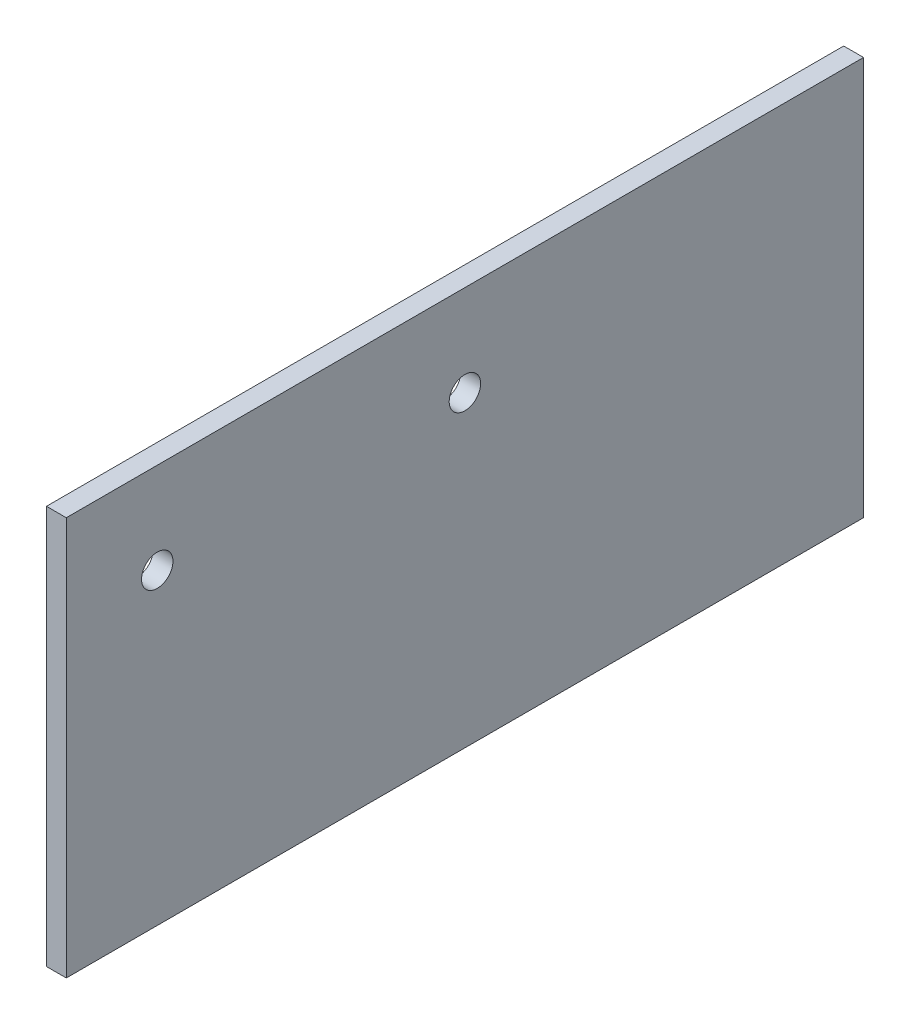
ISO-10303-21;
HEADER;
FILE_DESCRIPTION(('STEP AP214'),'2;1');
FILE_NAME('part.step','',(''),(''),'','','');
FILE_SCHEMA(('AUTOMOTIVE_DESIGN { 1 0 10303 214 1 1 1 1 }'));
ENDSEC;
DATA;
#1=APPLICATION_CONTEXT('core data for automotive mechanical design processes');
#2=APPLICATION_PROTOCOL_DEFINITION('international standard','automotive_design',2000,#1);
#3=PRODUCT_CONTEXT('',#1,'mechanical');
#4=PRODUCT('Part','Part','',(#3));
#5=PRODUCT_RELATED_PRODUCT_CATEGORY('part','',(#4));
#6=PRODUCT_DEFINITION_FORMATION('','',#4);
#7=PRODUCT_DEFINITION_CONTEXT('part definition',#1,'design');
#8=PRODUCT_DEFINITION('design','',#6,#7);
#9=PRODUCT_DEFINITION_SHAPE('','',#8);
#10=(LENGTH_UNIT() NAMED_UNIT(*) SI_UNIT(.MILLI.,.METRE.));
#11=(NAMED_UNIT(*) PLANE_ANGLE_UNIT() SI_UNIT($,.RADIAN.));
#12=(NAMED_UNIT(*) SI_UNIT($,.STERADIAN.) SOLID_ANGLE_UNIT());
#13=UNCERTAINTY_MEASURE_WITH_UNIT(LENGTH_MEASURE(1.E-05),#10,'distance_accuracy_value','');
#14=(GEOMETRIC_REPRESENTATION_CONTEXT(3) GLOBAL_UNCERTAINTY_ASSIGNED_CONTEXT((#13)) GLOBAL_UNIT_ASSIGNED_CONTEXT((#10,
#11,#12)) REPRESENTATION_CONTEXT('',''));
#15=CARTESIAN_POINT('',(0.,0.,0.));
#16=DIRECTION('',(0.,0.,1.));
#17=DIRECTION('',(1.,0.,0.));
#18=AXIS2_PLACEMENT_3D('',#15,#16,#17);
#19=CARTESIAN_POINT('',(2.25,0.,0.));
#20=DIRECTION('',(1.,0.,0.));
#21=DIRECTION('',(0.,0.,-1.));
#22=AXIS2_PLACEMENT_3D('',#19,#20,#21);
#23=PLANE('',#22);
#24=CARTESIAN_POINT('',(2.25,69.85,69.85));
#25=DIRECTION('',(1.,0.,0.));
#26=DIRECTION('',(0.,0.,-1.));
#27=AXIS2_PLACEMENT_3D('',#24,#25,#26);
#28=CIRCLE('',#27,3.56870000000001);
#29=CARTESIAN_POINT('',(2.25,69.85,66.2813));
#30=VERTEX_POINT('',#29);
#31=EDGE_CURVE('E108',#30,#30,#28,.T.);
#32=ORIENTED_EDGE('',*,*,#31,.F.);
#33=EDGE_LOOP('',(#32));
#34=FACE_BOUND('',#33,.T.);
#35=DIRECTION('',(0.,1.,0.));
#36=VECTOR('',#35,1.);
#37=CARTESIAN_POINT('',(2.25,90.5,-90.5));
#38=LINE('',#37,#36);
#39=CARTESIAN_POINT('',(2.25,0.,-90.5));
#40=VERTEX_POINT('',#39);
#41=CARTESIAN_POINT('',(2.25,90.5,-90.5));
#42=VERTEX_POINT('',#41);
#43=EDGE_CURVE('E86',#40,#42,#38,.T.);
#44=ORIENTED_EDGE('',*,*,#43,.T.);
#45=DIRECTION('',(0.,0.,1.));
#46=VECTOR('',#45,1.);
#47=CARTESIAN_POINT('',(2.25,90.5,90.5));
#48=LINE('',#47,#46);
#49=CARTESIAN_POINT('',(2.25,90.5,90.5));
#50=VERTEX_POINT('',#49);
#51=EDGE_CURVE('E81',#42,#50,#48,.T.);
#52=ORIENTED_EDGE('',*,*,#51,.T.);
#53=DIRECTION('',(0.,-1.,0.));
#54=VECTOR('',#53,1.);
#55=CARTESIAN_POINT('',(2.25,90.5,90.5));
#56=LINE('',#55,#54);
#57=CARTESIAN_POINT('',(2.25,0.,90.5));
#58=VERTEX_POINT('',#57);
#59=EDGE_CURVE('E84',#50,#58,#56,.T.);
#60=ORIENTED_EDGE('',*,*,#59,.T.);
#61=DIRECTION('',(0.,0.,-1.));
#62=VECTOR('',#61,1.);
#63=CARTESIAN_POINT('',(2.25,0.,90.5));
#64=LINE('',#63,#62);
#65=EDGE_CURVE('E51',#58,#40,#64,.T.);
#66=ORIENTED_EDGE('',*,*,#65,.T.);
#67=EDGE_LOOP('',(#44,#52,#60,#66));
#68=FACE_BOUND('',#67,.T.);
#69=CARTESIAN_POINT('',(2.25,69.85,0.));
#70=DIRECTION('',(1.,0.,0.));
#71=DIRECTION('',(0.,0.,-1.));
#72=AXIS2_PLACEMENT_3D('',#69,#70,#71);
#73=CIRCLE('',#72,3.56870000000001);
#74=CARTESIAN_POINT('',(2.25,69.85,-3.56870000000001));
#75=VERTEX_POINT('',#74);
#76=EDGE_CURVE('E116',#75,#75,#73,.T.);
#77=ORIENTED_EDGE('',*,*,#76,.F.);
#78=EDGE_LOOP('',(#77));
#79=FACE_BOUND('',#78,.T.);
#80=ADVANCED_FACE('F32',(#34,#68,#79),#23,.T.);
#81=CARTESIAN_POINT('',(-2.25,0.,0.));
#82=DIRECTION('',(1.,0.,0.));
#83=DIRECTION('',(0.,0.,-1.));
#84=AXIS2_PLACEMENT_3D('',#81,#82,#83);
#85=PLANE('',#84);
#86=CARTESIAN_POINT('',(-2.25,69.85,69.85));
#87=DIRECTION('',(1.,0.,0.));
#88=DIRECTION('',(0.,0.,-1.));
#89=AXIS2_PLACEMENT_3D('',#86,#87,#88);
#90=CIRCLE('',#89,3.56870000000001);
#91=CARTESIAN_POINT('',(-2.25,69.85,66.2813));
#92=VERTEX_POINT('',#91);
#93=EDGE_CURVE('E102',#92,#92,#90,.F.);
#94=ORIENTED_EDGE('',*,*,#93,.F.);
#95=EDGE_LOOP('',(#94));
#96=FACE_BOUND('',#95,.T.);
#97=DIRECTION('',(0.,1.,0.));
#98=VECTOR('',#97,1.);
#99=CARTESIAN_POINT('',(-2.25,90.5,-90.5));
#100=LINE('',#99,#98);
#101=CARTESIAN_POINT('',(-2.25,0.,-90.5));
#102=VERTEX_POINT('',#101);
#103=CARTESIAN_POINT('',(-2.25,90.5,-90.5));
#104=VERTEX_POINT('',#103);
#105=EDGE_CURVE('E99',#102,#104,#100,.T.);
#106=ORIENTED_EDGE('',*,*,#105,.F.);
#107=DIRECTION('',(0.,0.,-1.));
#108=VECTOR('',#107,1.);
#109=CARTESIAN_POINT('',(-2.25,0.,90.5));
#110=LINE('',#109,#108);
#111=CARTESIAN_POINT('',(-2.25,0.,90.5));
#112=VERTEX_POINT('',#111);
#113=EDGE_CURVE('E74',#112,#102,#110,.T.);
#114=ORIENTED_EDGE('',*,*,#113,.F.);
#115=DIRECTION('',(0.,-1.,0.));
#116=VECTOR('',#115,1.);
#117=CARTESIAN_POINT('',(-2.25,90.5,90.5));
#118=LINE('',#117,#116);
#119=CARTESIAN_POINT('',(-2.25,90.5,90.5));
#120=VERTEX_POINT('',#119);
#121=EDGE_CURVE('E68',#120,#112,#118,.T.);
#122=ORIENTED_EDGE('',*,*,#121,.F.);
#123=DIRECTION('',(0.,0.,1.));
#124=VECTOR('',#123,1.);
#125=CARTESIAN_POINT('',(-2.25,90.5,90.5));
#126=LINE('',#125,#124);
#127=EDGE_CURVE('E90',#104,#120,#126,.T.);
#128=ORIENTED_EDGE('',*,*,#127,.F.);
#129=EDGE_LOOP('',(#106,#114,#122,#128));
#130=FACE_BOUND('',#129,.T.);
#131=CARTESIAN_POINT('',(-2.25,69.85,0.));
#132=DIRECTION('',(1.,0.,0.));
#133=DIRECTION('',(0.,0.,-1.));
#134=AXIS2_PLACEMENT_3D('',#131,#132,#133);
#135=CIRCLE('',#134,3.56870000000001);
#136=CARTESIAN_POINT('',(-2.25,69.85,-3.56870000000001));
#137=VERTEX_POINT('',#136);
#138=EDGE_CURVE('E36',#137,#137,#135,.F.);
#139=ORIENTED_EDGE('',*,*,#138,.F.);
#140=EDGE_LOOP('',(#139));
#141=FACE_BOUND('',#140,.T.);
#142=ADVANCED_FACE('F124',(#96,#130,#141),#85,.F.);
#143=CARTESIAN_POINT('',(2.25,90.5,-90.5));
#144=DIRECTION('',(0.,0.,1.));
#145=DIRECTION('',(1.,0.,0.));
#146=AXIS2_PLACEMENT_3D('',#143,#144,#145);
#147=PLANE('',#146);
#148=ORIENTED_EDGE('',*,*,#105,.T.);
#149=DIRECTION('',(-1.,0.,0.));
#150=VECTOR('',#149,1.);
#151=CARTESIAN_POINT('',(2.25,90.5,-90.5));
#152=LINE('',#151,#150);
#153=EDGE_CURVE('E11',#42,#104,#152,.T.);
#154=ORIENTED_EDGE('',*,*,#153,.F.);
#155=ORIENTED_EDGE('',*,*,#43,.F.);
#156=DIRECTION('',(-1.,0.,0.));
#157=VECTOR('',#156,1.);
#158=CARTESIAN_POINT('',(2.25,0.,-90.5));
#159=LINE('',#158,#157);
#160=EDGE_CURVE('E95',#40,#102,#159,.T.);
#161=ORIENTED_EDGE('',*,*,#160,.T.);
#162=EDGE_LOOP('',(#148,#154,#155,#161));
#163=FACE_BOUND('',#162,.T.);
#164=ADVANCED_FACE('F34',(#163),#147,.F.);
#165=CARTESIAN_POINT('',(2.25,90.5,90.5));
#166=DIRECTION('',(0.,-1.,0.));
#167=DIRECTION('',(0.,0.,-1.));
#168=AXIS2_PLACEMENT_3D('',#165,#166,#167);
#169=PLANE('',#168);
#170=ORIENTED_EDGE('',*,*,#127,.T.);
#171=DIRECTION('',(-1.,0.,0.));
#172=VECTOR('',#171,1.);
#173=CARTESIAN_POINT('',(2.25,90.5,90.5));
#174=LINE('',#173,#172);
#175=EDGE_CURVE('E42',#50,#120,#174,.T.);
#176=ORIENTED_EDGE('',*,*,#175,.F.);
#177=ORIENTED_EDGE('',*,*,#51,.F.);
#178=ORIENTED_EDGE('',*,*,#153,.T.);
#179=EDGE_LOOP('',(#170,#176,#177,#178));
#180=FACE_BOUND('',#179,.T.);
#181=ADVANCED_FACE('F89',(#180),#169,.F.);
#182=CARTESIAN_POINT('',(2.25,90.5,90.5));
#183=DIRECTION('',(0.,0.,-1.));
#184=DIRECTION('',(-1.,0.,0.));
#185=AXIS2_PLACEMENT_3D('',#182,#183,#184);
#186=PLANE('',#185);
#187=ORIENTED_EDGE('',*,*,#121,.T.);
#188=DIRECTION('',(-1.,0.,0.));
#189=VECTOR('',#188,1.);
#190=CARTESIAN_POINT('',(2.25,0.,90.5));
#191=LINE('',#190,#189);
#192=EDGE_CURVE('E91',#58,#112,#191,.T.);
#193=ORIENTED_EDGE('',*,*,#192,.F.);
#194=ORIENTED_EDGE('',*,*,#59,.F.);
#195=ORIENTED_EDGE('',*,*,#175,.T.);
#196=EDGE_LOOP('',(#187,#193,#194,#195));
#197=FACE_BOUND('',#196,.T.);
#198=ADVANCED_FACE('F93',(#197),#186,.F.);
#199=CARTESIAN_POINT('',(2.25,0.,90.5));
#200=DIRECTION('',(0.,1.,0.));
#201=DIRECTION('',(0.,0.,1.));
#202=AXIS2_PLACEMENT_3D('',#199,#200,#201);
#203=PLANE('',#202);
#204=ORIENTED_EDGE('',*,*,#113,.T.);
#205=ORIENTED_EDGE('',*,*,#160,.F.);
#206=ORIENTED_EDGE('',*,*,#65,.F.);
#207=ORIENTED_EDGE('',*,*,#192,.T.);
#208=EDGE_LOOP('',(#204,#205,#206,#207));
#209=FACE_BOUND('',#208,.T.);
#210=ADVANCED_FACE('F137',(#209),#203,.F.);
#211=CARTESIAN_POINT('',(-2.25,69.85,69.85));
#212=DIRECTION('',(-1.,0.,0.));
#213=DIRECTION('',(0.,0.,1.));
#214=AXIS2_PLACEMENT_3D('',#211,#212,#213);
#215=CYLINDRICAL_SURFACE('',#214,3.56870000000001);
#216=ORIENTED_EDGE('',*,*,#31,.T.);
#217=EDGE_LOOP('',(#216));
#218=FACE_BOUND('',#217,.T.);
#219=ORIENTED_EDGE('',*,*,#93,.T.);
#220=EDGE_LOOP('',(#219));
#221=FACE_BOUND('',#220,.T.);
#222=ADVANCED_FACE('F134',(#218,#221),#215,.F.);
#223=CARTESIAN_POINT('',(-2.25,69.85,0.));
#224=DIRECTION('',(-1.,0.,0.));
#225=DIRECTION('',(0.,0.,1.));
#226=AXIS2_PLACEMENT_3D('',#223,#224,#225);
#227=CYLINDRICAL_SURFACE('',#226,3.56870000000001);
#228=ORIENTED_EDGE('',*,*,#76,.T.);
#229=EDGE_LOOP('',(#228));
#230=FACE_BOUND('',#229,.T.);
#231=ORIENTED_EDGE('',*,*,#138,.T.);
#232=EDGE_LOOP('',(#231));
#233=FACE_BOUND('',#232,.T.);
#234=ADVANCED_FACE('F121',(#230,#233),#227,.F.);
#235=CLOSED_SHELL('',(#80,#142,#164,#181,#198,#210,#222,#234));
#236=MANIFOLD_SOLID_BREP('B2',#235);
#237=ADVANCED_BREP_SHAPE_REPRESENTATION('',(#18,#236),#14);
#238=SHAPE_DEFINITION_REPRESENTATION(#9,#237);
ENDSEC;
END-ISO-10303-21;
